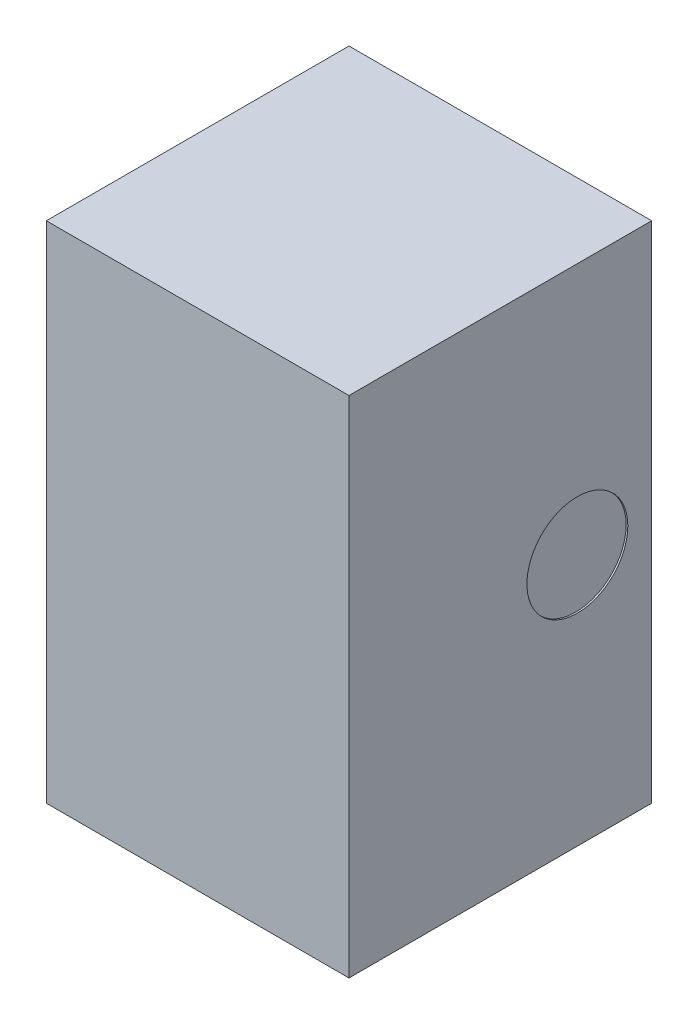
ISO-10303-21;
HEADER;
FILE_DESCRIPTION(('STEP AP214'),'2;1');
FILE_NAME('part.step','',(''),(''),'','','');
FILE_SCHEMA(('AUTOMOTIVE_DESIGN { 1 0 10303 214 1 1 1 1 }'));
ENDSEC;
DATA;
#1=APPLICATION_CONTEXT('core data for automotive mechanical design processes');
#2=APPLICATION_PROTOCOL_DEFINITION('international standard','automotive_design',2000,#1);
#3=PRODUCT_CONTEXT('',#1,'mechanical');
#4=PRODUCT('Part','Part','',(#3));
#5=PRODUCT_RELATED_PRODUCT_CATEGORY('part','',(#4));
#6=PRODUCT_DEFINITION_FORMATION('','',#4);
#7=PRODUCT_DEFINITION_CONTEXT('part definition',#1,'design');
#8=PRODUCT_DEFINITION('design','',#6,#7);
#9=PRODUCT_DEFINITION_SHAPE('','',#8);
#10=(LENGTH_UNIT() NAMED_UNIT(*) SI_UNIT(.MILLI.,.METRE.));
#11=(NAMED_UNIT(*) PLANE_ANGLE_UNIT() SI_UNIT($,.RADIAN.));
#12=(NAMED_UNIT(*) SI_UNIT($,.STERADIAN.) SOLID_ANGLE_UNIT());
#13=UNCERTAINTY_MEASURE_WITH_UNIT(LENGTH_MEASURE(1.E-05),#10,'distance_accuracy_value','');
#14=(GEOMETRIC_REPRESENTATION_CONTEXT(3) GLOBAL_UNCERTAINTY_ASSIGNED_CONTEXT((#13)) GLOBAL_UNIT_ASSIGNED_CONTEXT((#10,
#11,#12)) REPRESENTATION_CONTEXT('',''));
#15=CARTESIAN_POINT('',(0.,0.,0.));
#16=DIRECTION('',(0.,0.,1.));
#17=DIRECTION('',(1.,0.,0.));
#18=AXIS2_PLACEMENT_3D('',#15,#16,#17);
#19=CARTESIAN_POINT('',(-0.45,1.5,-0.449999999999999));
#20=DIRECTION('',(1.,0.,0.));
#21=DIRECTION('',(0.,0.,-1.));
#22=AXIS2_PLACEMENT_3D('',#19,#20,#21);
#23=PLANE('',#22);
#24=DIRECTION('',(0.,0.,1.));
#25=VECTOR('',#24,1.);
#26=CARTESIAN_POINT('',(-0.45,0.,-0.449999999999999));
#27=LINE('',#26,#25);
#28=CARTESIAN_POINT('',(-0.45,0.,-0.449999999999999));
#29=VERTEX_POINT('',#28);
#30=CARTESIAN_POINT('',(-0.449999999999999,0.,0.45));
#31=VERTEX_POINT('',#30);
#32=EDGE_CURVE('E98',#29,#31,#27,.T.);
#33=ORIENTED_EDGE('',*,*,#32,.T.);
#34=DIRECTION('',(0.,-1.,0.));
#35=VECTOR('',#34,1.);
#36=CARTESIAN_POINT('',(-0.449999999999999,1.5,0.45));
#37=LINE('',#36,#35);
#38=CARTESIAN_POINT('',(-0.449999999999999,1.5,0.45));
#39=VERTEX_POINT('',#38);
#40=EDGE_CURVE('E11',#39,#31,#37,.T.);
#41=ORIENTED_EDGE('',*,*,#40,.F.);
#42=DIRECTION('',(0.,0.,1.));
#43=VECTOR('',#42,1.);
#44=CARTESIAN_POINT('',(-0.45,1.5,-0.449999999999999));
#45=LINE('',#44,#43);
#46=CARTESIAN_POINT('',(-0.45,1.5,-0.449999999999999));
#47=VERTEX_POINT('',#46);
#48=EDGE_CURVE('E86',#47,#39,#45,.T.);
#49=ORIENTED_EDGE('',*,*,#48,.F.);
#50=DIRECTION('',(0.,-1.,0.));
#51=VECTOR('',#50,1.);
#52=CARTESIAN_POINT('',(-0.45,1.5,-0.449999999999999));
#53=LINE('',#52,#51);
#54=EDGE_CURVE('E94',#47,#29,#53,.T.);
#55=ORIENTED_EDGE('',*,*,#54,.T.);
#56=EDGE_LOOP('',(#33,#41,#49,#55));
#57=FACE_BOUND('',#56,.T.);
#58=ADVANCED_FACE('F35',(#57),#23,.F.);
#59=CARTESIAN_POINT('',(-0.449999999999999,1.5,0.45));
#60=DIRECTION('',(0.,0.,-1.));
#61=DIRECTION('',(-1.,0.,0.));
#62=AXIS2_PLACEMENT_3D('',#59,#60,#61);
#63=PLANE('',#62);
#64=DIRECTION('',(1.,0.,0.));
#65=VECTOR('',#64,1.);
#66=CARTESIAN_POINT('',(-0.449999999999999,0.,0.45));
#67=LINE('',#66,#65);
#68=CARTESIAN_POINT('',(0.45,0.,0.45));
#69=VERTEX_POINT('',#68);
#70=EDGE_CURVE('E90',#31,#69,#67,.T.);
#71=ORIENTED_EDGE('',*,*,#70,.T.);
#72=DIRECTION('',(0.,-1.,0.));
#73=VECTOR('',#72,1.);
#74=CARTESIAN_POINT('',(0.45,1.5,0.45));
#75=LINE('',#74,#73);
#76=CARTESIAN_POINT('',(0.45,1.5,0.45));
#77=VERTEX_POINT('',#76);
#78=EDGE_CURVE('E43',#77,#69,#75,.T.);
#79=ORIENTED_EDGE('',*,*,#78,.F.);
#80=DIRECTION('',(1.,0.,0.));
#81=VECTOR('',#80,1.);
#82=CARTESIAN_POINT('',(-0.449999999999999,1.5,0.45));
#83=LINE('',#82,#81);
#84=EDGE_CURVE('E81',#39,#77,#83,.T.);
#85=ORIENTED_EDGE('',*,*,#84,.F.);
#86=ORIENTED_EDGE('',*,*,#40,.T.);
#87=EDGE_LOOP('',(#71,#79,#85,#86));
#88=FACE_BOUND('',#87,.T.);
#89=ADVANCED_FACE('F89',(#88),#63,.F.);
#90=CARTESIAN_POINT('',(0.45,1.5,-0.45));
#91=DIRECTION('',(-1.,0.,0.));
#92=DIRECTION('',(0.,0.,1.));
#93=AXIS2_PLACEMENT_3D('',#90,#91,#92);
#94=PLANE('',#93);
#95=CARTESIAN_POINT('',(0.45,0.75,-0.229047371160854));
#96=DIRECTION('',(1.,0.,0.));
#97=DIRECTION('',(0.,0.,-1.));
#98=AXIS2_PLACEMENT_3D('',#95,#96,#97);
#99=CIRCLE('',#98,0.15);
#100=CARTESIAN_POINT('',(0.45,0.75,-0.379047371160854));
#101=VERTEX_POINT('',#100);
#102=EDGE_CURVE('E112',#101,#101,#99,.T.);
#103=ORIENTED_EDGE('',*,*,#102,.F.);
#104=EDGE_LOOP('',(#103));
#105=FACE_BOUND('',#104,.T.);
#106=DIRECTION('',(0.,0.,-1.));
#107=VECTOR('',#106,1.);
#108=CARTESIAN_POINT('',(0.45,0.,-0.45));
#109=LINE('',#108,#107);
#110=CARTESIAN_POINT('',(0.45,0.,-0.45));
#111=VERTEX_POINT('',#110);
#112=EDGE_CURVE('E68',#69,#111,#109,.T.);
#113=ORIENTED_EDGE('',*,*,#112,.T.);
#114=DIRECTION('',(0.,-1.,0.));
#115=VECTOR('',#114,1.);
#116=CARTESIAN_POINT('',(0.45,1.5,-0.45));
#117=LINE('',#116,#115);
#118=CARTESIAN_POINT('',(0.45,1.5,-0.45));
#119=VERTEX_POINT('',#118);
#120=EDGE_CURVE('E91',#119,#111,#117,.T.);
#121=ORIENTED_EDGE('',*,*,#120,.F.);
#122=DIRECTION('',(0.,0.,-1.));
#123=VECTOR('',#122,1.);
#124=CARTESIAN_POINT('',(0.45,1.5,-0.45));
#125=LINE('',#124,#123);
#126=EDGE_CURVE('E84',#77,#119,#125,.T.);
#127=ORIENTED_EDGE('',*,*,#126,.F.);
#128=ORIENTED_EDGE('',*,*,#78,.T.);
#129=EDGE_LOOP('',(#113,#121,#127,#128));
#130=FACE_BOUND('',#129,.T.);
#131=ADVANCED_FACE('F92',(#105,#130),#94,.F.);
#132=CARTESIAN_POINT('',(-0.45,1.5,-0.449999999999999));
#133=DIRECTION('',(0.,0.,1.));
#134=DIRECTION('',(1.,0.,0.));
#135=AXIS2_PLACEMENT_3D('',#132,#133,#134);
#136=PLANE('',#135);
#137=DIRECTION('',(-1.,0.,0.));
#138=VECTOR('',#137,1.);
#139=CARTESIAN_POINT('',(-0.45,0.,-0.449999999999999));
#140=LINE('',#139,#138);
#141=EDGE_CURVE('E74',#111,#29,#140,.T.);
#142=ORIENTED_EDGE('',*,*,#141,.T.);
#143=ORIENTED_EDGE('',*,*,#54,.F.);
#144=DIRECTION('',(-1.,0.,0.));
#145=VECTOR('',#144,1.);
#146=CARTESIAN_POINT('',(-0.45,1.5,-0.449999999999999));
#147=LINE('',#146,#145);
#148=EDGE_CURVE('E51',#119,#47,#147,.T.);
#149=ORIENTED_EDGE('',*,*,#148,.F.);
#150=ORIENTED_EDGE('',*,*,#120,.T.);
#151=EDGE_LOOP('',(#142,#143,#149,#150));
#152=FACE_BOUND('',#151,.T.);
#153=ADVANCED_FACE('F106',(#152),#136,.F.);
#154=CARTESIAN_POINT('',(0.,1.5,0.));
#155=DIRECTION('',(0.,1.,0.));
#156=DIRECTION('',(0.,0.,1.));
#157=AXIS2_PLACEMENT_3D('',#154,#155,#156);
#158=PLANE('',#157);
#159=ORIENTED_EDGE('',*,*,#48,.T.);
#160=ORIENTED_EDGE('',*,*,#84,.T.);
#161=ORIENTED_EDGE('',*,*,#126,.T.);
#162=ORIENTED_EDGE('',*,*,#148,.T.);
#163=EDGE_LOOP('',(#159,#160,#161,#162));
#164=FACE_BOUND('',#163,.T.);
#165=ADVANCED_FACE('F82',(#164),#158,.T.);
#166=CARTESIAN_POINT('',(0.,0.,0.));
#167=DIRECTION('',(0.,1.,0.));
#168=DIRECTION('',(0.,0.,1.));
#169=AXIS2_PLACEMENT_3D('',#166,#167,#168);
#170=PLANE('',#169);
#171=ORIENTED_EDGE('',*,*,#32,.F.);
#172=ORIENTED_EDGE('',*,*,#141,.F.);
#173=ORIENTED_EDGE('',*,*,#112,.F.);
#174=ORIENTED_EDGE('',*,*,#70,.F.);
#175=EDGE_LOOP('',(#171,#172,#173,#174));
#176=FACE_BOUND('',#175,.T.);
#177=ADVANCED_FACE('F109',(#176),#170,.F.);
#178=CARTESIAN_POINT('',(0.445,0.75,-0.229047371160854));
#179=DIRECTION('',(1.,0.,0.));
#180=DIRECTION('',(0.,0.,-1.));
#181=AXIS2_PLACEMENT_3D('',#178,#179,#180);
#182=CYLINDRICAL_SURFACE('',#181,0.15);
#183=CARTESIAN_POINT('',(0.445,0.75,-0.229047371160854));
#184=DIRECTION('',(1.,0.,0.));
#185=DIRECTION('',(0.,0.,-1.));
#186=AXIS2_PLACEMENT_3D('',#183,#184,#185);
#187=CIRCLE('',#186,0.15);
#188=CARTESIAN_POINT('',(0.445,0.75,-0.379047371160854));
#189=VERTEX_POINT('',#188);
#190=EDGE_CURVE('E101',#189,#189,#187,.T.);
#191=ORIENTED_EDGE('',*,*,#190,.F.);
#192=EDGE_LOOP('',(#191));
#193=FACE_BOUND('',#192,.T.);
#194=ORIENTED_EDGE('',*,*,#102,.T.);
#195=EDGE_LOOP('',(#194));
#196=FACE_BOUND('',#195,.T.);
#197=ADVANCED_FACE('F120',(#193,#196),#182,.F.);
#198=CARTESIAN_POINT('',(0.445,0.75,-0.229047371160854));
#199=DIRECTION('',(1.,0.,0.));
#200=DIRECTION('',(0.,0.,-1.));
#201=AXIS2_PLACEMENT_3D('',#198,#199,#200);
#202=PLANE('',#201);
#203=ORIENTED_EDGE('',*,*,#190,.T.);
#204=EDGE_LOOP('',(#203));
#205=FACE_BOUND('',#204,.T.);
#206=ADVANCED_FACE('F118',(#205),#202,.T.);
#207=CLOSED_SHELL('',(#58,#89,#131,#153,#165,#177,#197,#206));
#208=MANIFOLD_SOLID_BREP('B2',#207);
#209=ADVANCED_BREP_SHAPE_REPRESENTATION('',(#18,#208),#14);
#210=SHAPE_DEFINITION_REPRESENTATION(#9,#209);
ENDSEC;
END-ISO-10303-21;
